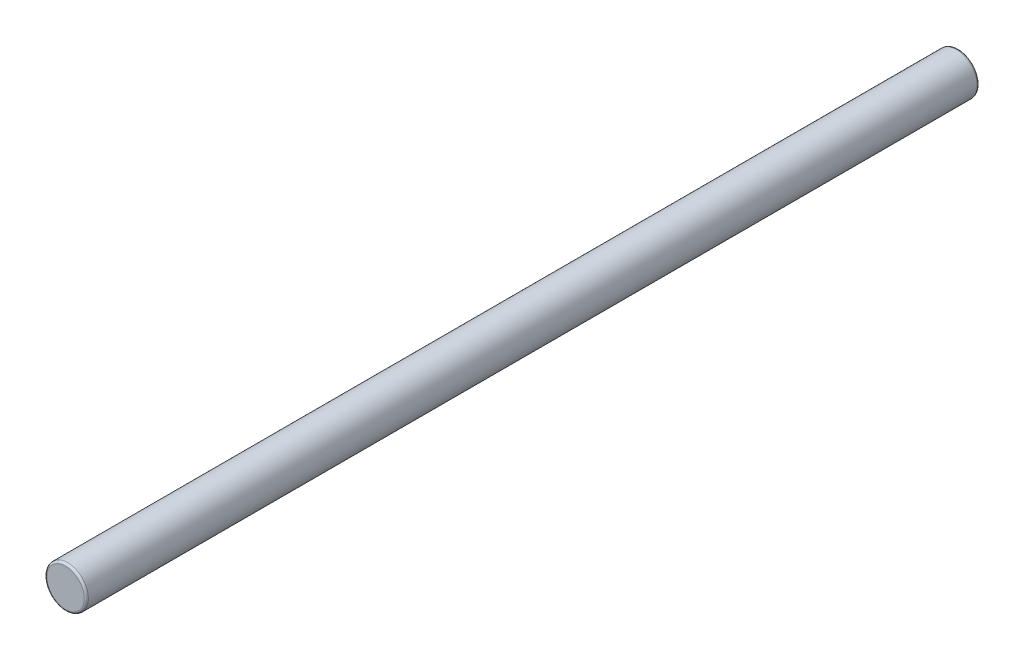
ISO-10303-21;
HEADER;
FILE_DESCRIPTION(('STEP AP214'),'2;1');
FILE_NAME('part.step','',(''),(''),'','','');
FILE_SCHEMA(('AUTOMOTIVE_DESIGN { 1 0 10303 214 1 1 1 1 }'));
ENDSEC;
DATA;
#1=APPLICATION_CONTEXT('core data for automotive mechanical design processes');
#2=APPLICATION_PROTOCOL_DEFINITION('international standard','automotive_design',2000,#1);
#3=PRODUCT_CONTEXT('',#1,'mechanical');
#4=PRODUCT('Part','Part','',(#3));
#5=PRODUCT_RELATED_PRODUCT_CATEGORY('part','',(#4));
#6=PRODUCT_DEFINITION_FORMATION('','',#4);
#7=PRODUCT_DEFINITION_CONTEXT('part definition',#1,'design');
#8=PRODUCT_DEFINITION('design','',#6,#7);
#9=PRODUCT_DEFINITION_SHAPE('','',#8);
#10=(LENGTH_UNIT() NAMED_UNIT(*) SI_UNIT(.MILLI.,.METRE.));
#11=(NAMED_UNIT(*) PLANE_ANGLE_UNIT() SI_UNIT($,.RADIAN.));
#12=(NAMED_UNIT(*) SI_UNIT($,.STERADIAN.) SOLID_ANGLE_UNIT());
#13=UNCERTAINTY_MEASURE_WITH_UNIT(LENGTH_MEASURE(1.E-05),#10,'distance_accuracy_value','');
#14=(GEOMETRIC_REPRESENTATION_CONTEXT(3) GLOBAL_UNCERTAINTY_ASSIGNED_CONTEXT((#13)) GLOBAL_UNIT_ASSIGNED_CONTEXT((#10,
#11,#12)) REPRESENTATION_CONTEXT('',''));
#15=CARTESIAN_POINT('',(0.,0.,0.));
#16=DIRECTION('',(0.,0.,1.));
#17=DIRECTION('',(1.,0.,0.));
#18=AXIS2_PLACEMENT_3D('',#15,#16,#17);
#19=CARTESIAN_POINT('',(0.,0.,2.));
#20=DIRECTION('',(0.,0.,-1.));
#21=DIRECTION('',(-1.,0.,0.));
#22=AXIS2_PLACEMENT_3D('',#19,#20,#21);
#23=CYLINDRICAL_SURFACE('',#22,0.5);
#24=CARTESIAN_POINT('',(0.,0.,13.95));
#25=DIRECTION('',(0.,0.,-1.));
#26=DIRECTION('',(-1.,0.,0.));
#27=AXIS2_PLACEMENT_3D('',#24,#25,#26);
#28=CIRCLE('',#27,0.5);
#29=CARTESIAN_POINT('',(-0.5,0.,13.95));
#30=VERTEX_POINT('',#29);
#31=EDGE_CURVE('E42',#30,#30,#28,.T.);
#32=ORIENTED_EDGE('',*,*,#31,.T.);
#33=EDGE_LOOP('',(#32));
#34=FACE_BOUND('',#33,.T.);
#35=CARTESIAN_POINT('',(0.,0.,-7.45));
#36=DIRECTION('',(0.,0.,-1.));
#37=DIRECTION('',(-1.,0.,0.));
#38=AXIS2_PLACEMENT_3D('',#35,#36,#37);
#39=CIRCLE('',#38,0.5);
#40=CARTESIAN_POINT('',(-0.5,0.,-7.45));
#41=VERTEX_POINT('',#40);
#42=EDGE_CURVE('E46',#41,#41,#39,.F.);
#43=ORIENTED_EDGE('',*,*,#42,.T.);
#44=EDGE_LOOP('',(#43));
#45=FACE_BOUND('',#44,.T.);
#46=ADVANCED_FACE('F31',(#34,#45),#23,.T.);
#47=CARTESIAN_POINT('',(0.,0.,14.));
#48=DIRECTION('',(0.,0.,-1.));
#49=DIRECTION('',(-1.,0.,0.));
#50=AXIS2_PLACEMENT_3D('',#47,#48,#49);
#51=PLANE('',#50);
#52=CARTESIAN_POINT('',(0.,0.,14.));
#53=DIRECTION('',(0.,0.,-1.));
#54=DIRECTION('',(-1.,0.,0.));
#55=AXIS2_PLACEMENT_3D('',#52,#53,#54);
#56=CIRCLE('',#55,0.45);
#57=CARTESIAN_POINT('',(-0.45,0.,14.));
#58=VERTEX_POINT('',#57);
#59=EDGE_CURVE('E38',#58,#58,#56,.F.);
#60=ORIENTED_EDGE('',*,*,#59,.T.);
#61=EDGE_LOOP('',(#60));
#62=FACE_BOUND('',#61,.T.);
#63=ADVANCED_FACE('F62',(#62),#51,.F.);
#64=CARTESIAN_POINT('',(0.,0.,-7.5));
#65=DIRECTION('',(0.,0.,-1.));
#66=DIRECTION('',(-1.,0.,0.));
#67=AXIS2_PLACEMENT_3D('',#64,#65,#66);
#68=PLANE('',#67);
#69=CARTESIAN_POINT('',(0.,0.,-7.5));
#70=DIRECTION('',(0.,0.,-1.));
#71=DIRECTION('',(-1.,0.,0.));
#72=AXIS2_PLACEMENT_3D('',#69,#70,#71);
#73=CIRCLE('',#72,0.45);
#74=CARTESIAN_POINT('',(-0.45,0.,-7.5));
#75=VERTEX_POINT('',#74);
#76=EDGE_CURVE('E10',#75,#75,#73,.T.);
#77=ORIENTED_EDGE('',*,*,#76,.T.);
#78=EDGE_LOOP('',(#77));
#79=FACE_BOUND('',#78,.T.);
#80=ADVANCED_FACE('F59',(#79),#68,.T.);
#81=CARTESIAN_POINT('',(0.,0.,13.95));
#82=DIRECTION('',(0.,0.,-1.));
#83=DIRECTION('',(-1.,0.,0.));
#84=AXIS2_PLACEMENT_3D('',#81,#82,#83);
#85=TOROIDAL_SURFACE('',#84,0.45,0.05);
#86=ORIENTED_EDGE('',*,*,#59,.F.);
#87=EDGE_LOOP('',(#86));
#88=FACE_BOUND('',#87,.T.);
#89=ORIENTED_EDGE('',*,*,#31,.F.);
#90=EDGE_LOOP('',(#89));
#91=FACE_BOUND('',#90,.T.);
#92=ADVANCED_FACE('F55',(#88,#91),#85,.T.);
#93=CARTESIAN_POINT('',(0.,0.,-7.45));
#94=DIRECTION('',(0.,0.,-1.));
#95=DIRECTION('',(-1.,0.,0.));
#96=AXIS2_PLACEMENT_3D('',#93,#94,#95);
#97=TOROIDAL_SURFACE('',#96,0.45,0.05);
#98=ORIENTED_EDGE('',*,*,#42,.F.);
#99=EDGE_LOOP('',(#98));
#100=FACE_BOUND('',#99,.T.);
#101=ORIENTED_EDGE('',*,*,#76,.F.);
#102=EDGE_LOOP('',(#101));
#103=FACE_BOUND('',#102,.T.);
#104=ADVANCED_FACE('F33',(#100,#103),#97,.T.);
#105=CLOSED_SHELL('',(#46,#63,#80,#92,#104));
#106=MANIFOLD_SOLID_BREP('B2',#105);
#107=ADVANCED_BREP_SHAPE_REPRESENTATION('',(#18,#106),#14);
#108=SHAPE_DEFINITION_REPRESENTATION(#9,#107);
ENDSEC;
END-ISO-10303-21;
